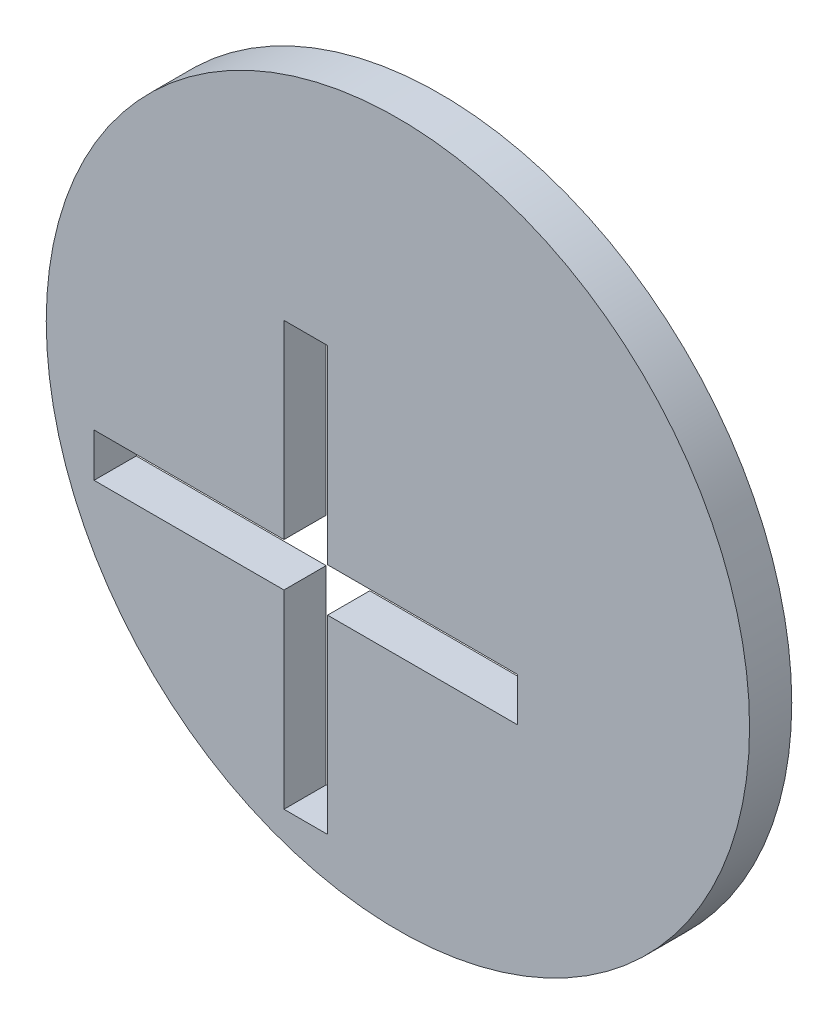
ISO-10303-21;
HEADER;
FILE_DESCRIPTION(('STEP AP214'),'2;1');
FILE_NAME('part.step','',(''),(''),'','','');
FILE_SCHEMA(('AUTOMOTIVE_DESIGN { 1 0 10303 214 1 1 1 1 }'));
ENDSEC;
DATA;
#1=APPLICATION_CONTEXT('core data for automotive mechanical design processes');
#2=APPLICATION_PROTOCOL_DEFINITION('international standard','automotive_design',2000,#1);
#3=PRODUCT_CONTEXT('',#1,'mechanical');
#4=PRODUCT('Part','Part','',(#3));
#5=PRODUCT_RELATED_PRODUCT_CATEGORY('part','',(#4));
#6=PRODUCT_DEFINITION_FORMATION('','',#4);
#7=PRODUCT_DEFINITION_CONTEXT('part definition',#1,'design');
#8=PRODUCT_DEFINITION('design','',#6,#7);
#9=PRODUCT_DEFINITION_SHAPE('','',#8);
#10=(LENGTH_UNIT() NAMED_UNIT(*) SI_UNIT(.MILLI.,.METRE.));
#11=(NAMED_UNIT(*) PLANE_ANGLE_UNIT() SI_UNIT($,.RADIAN.));
#12=(NAMED_UNIT(*) SI_UNIT($,.STERADIAN.) SOLID_ANGLE_UNIT());
#13=UNCERTAINTY_MEASURE_WITH_UNIT(LENGTH_MEASURE(1.E-05),#10,'distance_accuracy_value','');
#14=(GEOMETRIC_REPRESENTATION_CONTEXT(3) GLOBAL_UNCERTAINTY_ASSIGNED_CONTEXT((#13)) GLOBAL_UNIT_ASSIGNED_CONTEXT((#10,
#11,#12)) REPRESENTATION_CONTEXT('',''));
#15=CARTESIAN_POINT('',(0.,0.,0.));
#16=DIRECTION('',(0.,0.,1.));
#17=DIRECTION('',(1.,0.,0.));
#18=AXIS2_PLACEMENT_3D('',#15,#16,#17);
#19=CARTESIAN_POINT('',(6.55,6.55,1.5));
#20=DIRECTION('',(0.,0.,1.));
#21=DIRECTION('',(1.,0.,0.));
#22=AXIS2_PLACEMENT_3D('',#19,#20,#21);
#23=PLANE('',#22);
#24=CARTESIAN_POINT('',(6.55,6.55,1.5));
#25=DIRECTION('',(0.,0.,1.));
#26=DIRECTION('',(1.,0.,0.));
#27=AXIS2_PLACEMENT_3D('',#24,#25,#26);
#28=CIRCLE('',#27,25.);
#29=CARTESIAN_POINT('',(31.55,6.55,1.5));
#30=VERTEX_POINT('',#29);
#31=EDGE_CURVE('E11',#30,#30,#28,.T.);
#32=ORIENTED_EDGE('',*,*,#31,.T.);
#33=EDGE_LOOP('',(#32));
#34=FACE_BOUND('',#33,.T.);
#35=DIRECTION('',(0.,1.,0.));
#36=VECTOR('',#35,1.);
#37=CARTESIAN_POINT('',(15.05,1.55,1.5));
#38=LINE('',#37,#36);
#39=CARTESIAN_POINT('',(15.05,-1.55,1.5));
#40=VERTEX_POINT('',#39);
#41=CARTESIAN_POINT('',(15.05,1.55,1.5));
#42=VERTEX_POINT('',#41);
#43=EDGE_CURVE('E130',#40,#42,#38,.T.);
#44=ORIENTED_EDGE('',*,*,#43,.F.);
#45=DIRECTION('',(1.,0.,0.));
#46=VECTOR('',#45,1.);
#47=CARTESIAN_POINT('',(1.55,-1.55,1.5));
#48=LINE('',#47,#46);
#49=CARTESIAN_POINT('',(1.55,-1.55,1.5));
#50=VERTEX_POINT('',#49);
#51=EDGE_CURVE('E122',#50,#40,#48,.T.);
#52=ORIENTED_EDGE('',*,*,#51,.F.);
#53=DIRECTION('',(0.,1.,0.));
#54=VECTOR('',#53,1.);
#55=CARTESIAN_POINT('',(1.55000000000001,-15.05,1.5));
#56=LINE('',#55,#54);
#57=CARTESIAN_POINT('',(1.55000000000001,-15.05,1.5));
#58=VERTEX_POINT('',#57);
#59=EDGE_CURVE('E162',#58,#50,#56,.T.);
#60=ORIENTED_EDGE('',*,*,#59,.F.);
#61=DIRECTION('',(1.,0.,0.));
#62=VECTOR('',#61,1.);
#63=CARTESIAN_POINT('',(-1.54999999999999,-15.05,1.5));
#64=LINE('',#63,#62);
#65=CARTESIAN_POINT('',(-1.54999999999999,-15.05,1.5));
#66=VERTEX_POINT('',#65);
#67=EDGE_CURVE('E160',#66,#58,#64,.T.);
#68=ORIENTED_EDGE('',*,*,#67,.F.);
#69=DIRECTION('',(0.,-1.,0.));
#70=VECTOR('',#69,1.);
#71=CARTESIAN_POINT('',(-1.54999999999999,-15.05,1.5));
#72=LINE('',#71,#70);
#73=CARTESIAN_POINT('',(-1.55,-1.55,1.5));
#74=VERTEX_POINT('',#73);
#75=EDGE_CURVE('E158',#74,#66,#72,.T.);
#76=ORIENTED_EDGE('',*,*,#75,.F.);
#77=DIRECTION('',(1.,0.,0.));
#78=VECTOR('',#77,1.);
#79=CARTESIAN_POINT('',(-15.05,-1.55,1.5));
#80=LINE('',#79,#78);
#81=CARTESIAN_POINT('',(-15.05,-1.55,1.5));
#82=VERTEX_POINT('',#81);
#83=EDGE_CURVE('E156',#82,#74,#80,.T.);
#84=ORIENTED_EDGE('',*,*,#83,.F.);
#85=DIRECTION('',(0.,-1.,0.));
#86=VECTOR('',#85,1.);
#87=CARTESIAN_POINT('',(-15.05,1.55,1.5));
#88=LINE('',#87,#86);
#89=CARTESIAN_POINT('',(-15.05,1.55,1.5));
#90=VERTEX_POINT('',#89);
#91=EDGE_CURVE('E154',#90,#82,#88,.T.);
#92=ORIENTED_EDGE('',*,*,#91,.F.);
#93=DIRECTION('',(-1.,0.,0.));
#94=VECTOR('',#93,1.);
#95=CARTESIAN_POINT('',(-15.05,1.55,1.5));
#96=LINE('',#95,#94);
#97=CARTESIAN_POINT('',(-1.55,1.55,1.5));
#98=VERTEX_POINT('',#97);
#99=EDGE_CURVE('E152',#98,#90,#96,.T.);
#100=ORIENTED_EDGE('',*,*,#99,.F.);
#101=DIRECTION('',(0.,-1.,0.));
#102=VECTOR('',#101,1.);
#103=CARTESIAN_POINT('',(-1.55,1.55,1.5));
#104=LINE('',#103,#102);
#105=CARTESIAN_POINT('',(-1.54999999999999,15.05,1.5));
#106=VERTEX_POINT('',#105);
#107=EDGE_CURVE('E150',#106,#98,#104,.T.);
#108=ORIENTED_EDGE('',*,*,#107,.F.);
#109=DIRECTION('',(-1.,0.,0.));
#110=VECTOR('',#109,1.);
#111=CARTESIAN_POINT('',(-1.54999999999999,15.05,1.5));
#112=LINE('',#111,#110);
#113=CARTESIAN_POINT('',(1.55000000000001,15.05,1.5));
#114=VERTEX_POINT('',#113);
#115=EDGE_CURVE('E148',#114,#106,#112,.T.);
#116=ORIENTED_EDGE('',*,*,#115,.F.);
#117=DIRECTION('',(0.,1.,0.));
#118=VECTOR('',#117,1.);
#119=CARTESIAN_POINT('',(1.55,1.55,1.5));
#120=LINE('',#119,#118);
#121=CARTESIAN_POINT('',(1.55,1.55,1.5));
#122=VERTEX_POINT('',#121);
#123=EDGE_CURVE('E144',#122,#114,#120,.T.);
#124=ORIENTED_EDGE('',*,*,#123,.F.);
#125=DIRECTION('',(-1.,0.,0.));
#126=VECTOR('',#125,1.);
#127=CARTESIAN_POINT('',(1.55,1.55,1.5));
#128=LINE('',#127,#126);
#129=EDGE_CURVE('E142',#42,#122,#128,.T.);
#130=ORIENTED_EDGE('',*,*,#129,.F.);
#131=EDGE_LOOP('',(#44,#52,#60,#68,#76,#84,#92,#100,#108,#116,#124,#130));
#132=FACE_BOUND('',#131,.T.);
#133=ADVANCED_FACE('F33',(#34,#132),#23,.T.);
#134=CARTESIAN_POINT('',(6.55,6.55,-1.5));
#135=DIRECTION('',(0.,0.,1.));
#136=DIRECTION('',(1.,0.,0.));
#137=AXIS2_PLACEMENT_3D('',#134,#135,#136);
#138=PLANE('',#137);
#139=CARTESIAN_POINT('',(6.55,6.55,-1.5));
#140=DIRECTION('',(0.,0.,1.));
#141=DIRECTION('',(1.,0.,0.));
#142=AXIS2_PLACEMENT_3D('',#139,#140,#141);
#143=CIRCLE('',#142,25.);
#144=CARTESIAN_POINT('',(31.55,6.55,-1.5));
#145=VERTEX_POINT('',#144);
#146=EDGE_CURVE('E37',#145,#145,#143,.T.);
#147=ORIENTED_EDGE('',*,*,#146,.F.);
#148=EDGE_LOOP('',(#147));
#149=FACE_BOUND('',#148,.T.);
#150=DIRECTION('',(1.,0.,0.));
#151=VECTOR('',#150,1.);
#152=CARTESIAN_POINT('',(1.55,-1.55,-1.5));
#153=LINE('',#152,#151);
#154=CARTESIAN_POINT('',(1.55,-1.55,-1.5));
#155=VERTEX_POINT('',#154);
#156=CARTESIAN_POINT('',(15.05,-1.55,-1.5));
#157=VERTEX_POINT('',#156);
#158=EDGE_CURVE('E56',#155,#157,#153,.T.);
#159=ORIENTED_EDGE('',*,*,#158,.T.);
#160=DIRECTION('',(0.,1.,0.));
#161=VECTOR('',#160,1.);
#162=CARTESIAN_POINT('',(15.05,1.55,-1.5));
#163=LINE('',#162,#161);
#164=CARTESIAN_POINT('',(15.05,1.55,-1.5));
#165=VERTEX_POINT('',#164);
#166=EDGE_CURVE('E137',#157,#165,#163,.T.);
#167=ORIENTED_EDGE('',*,*,#166,.T.);
#168=DIRECTION('',(-1.,0.,0.));
#169=VECTOR('',#168,1.);
#170=CARTESIAN_POINT('',(1.55,1.55,-1.5));
#171=LINE('',#170,#169);
#172=CARTESIAN_POINT('',(1.55,1.55,-1.5));
#173=VERTEX_POINT('',#172);
#174=EDGE_CURVE('E166',#165,#173,#171,.T.);
#175=ORIENTED_EDGE('',*,*,#174,.T.);
#176=DIRECTION('',(0.,1.,0.));
#177=VECTOR('',#176,1.);
#178=CARTESIAN_POINT('',(1.55,1.55,-1.5));
#179=LINE('',#178,#177);
#180=CARTESIAN_POINT('',(1.55000000000001,15.05,-1.5));
#181=VERTEX_POINT('',#180);
#182=EDGE_CURVE('E169',#173,#181,#179,.T.);
#183=ORIENTED_EDGE('',*,*,#182,.T.);
#184=DIRECTION('',(-1.,0.,0.));
#185=VECTOR('',#184,1.);
#186=CARTESIAN_POINT('',(-1.54999999999999,15.05,-1.5));
#187=LINE('',#186,#185);
#188=CARTESIAN_POINT('',(-1.54999999999999,15.05,-1.5));
#189=VERTEX_POINT('',#188);
#190=EDGE_CURVE('E172',#181,#189,#187,.T.);
#191=ORIENTED_EDGE('',*,*,#190,.T.);
#192=DIRECTION('',(0.,-1.,0.));
#193=VECTOR('',#192,1.);
#194=CARTESIAN_POINT('',(-1.55,1.55,-1.5));
#195=LINE('',#194,#193);
#196=CARTESIAN_POINT('',(-1.55,1.55,-1.5));
#197=VERTEX_POINT('',#196);
#198=EDGE_CURVE('E175',#189,#197,#195,.T.);
#199=ORIENTED_EDGE('',*,*,#198,.T.);
#200=DIRECTION('',(-1.,0.,0.));
#201=VECTOR('',#200,1.);
#202=CARTESIAN_POINT('',(-15.05,1.55,-1.5));
#203=LINE('',#202,#201);
#204=CARTESIAN_POINT('',(-15.05,1.55,-1.5));
#205=VERTEX_POINT('',#204);
#206=EDGE_CURVE('E178',#197,#205,#203,.T.);
#207=ORIENTED_EDGE('',*,*,#206,.T.);
#208=DIRECTION('',(0.,-1.,0.));
#209=VECTOR('',#208,1.);
#210=CARTESIAN_POINT('',(-15.05,1.55,-1.5));
#211=LINE('',#210,#209);
#212=CARTESIAN_POINT('',(-15.05,-1.55,-1.5));
#213=VERTEX_POINT('',#212);
#214=EDGE_CURVE('E181',#205,#213,#211,.T.);
#215=ORIENTED_EDGE('',*,*,#214,.T.);
#216=DIRECTION('',(1.,0.,0.));
#217=VECTOR('',#216,1.);
#218=CARTESIAN_POINT('',(-15.05,-1.55,-1.5));
#219=LINE('',#218,#217);
#220=CARTESIAN_POINT('',(-1.55,-1.55,-1.5));
#221=VERTEX_POINT('',#220);
#222=EDGE_CURVE('E184',#213,#221,#219,.T.);
#223=ORIENTED_EDGE('',*,*,#222,.T.);
#224=DIRECTION('',(0.,-1.,0.));
#225=VECTOR('',#224,1.);
#226=CARTESIAN_POINT('',(-1.54999999999999,-15.05,-1.5));
#227=LINE('',#226,#225);
#228=CARTESIAN_POINT('',(-1.54999999999999,-15.05,-1.5));
#229=VERTEX_POINT('',#228);
#230=EDGE_CURVE('E187',#221,#229,#227,.T.);
#231=ORIENTED_EDGE('',*,*,#230,.T.);
#232=DIRECTION('',(1.,0.,0.));
#233=VECTOR('',#232,1.);
#234=CARTESIAN_POINT('',(-1.54999999999999,-15.05,-1.5));
#235=LINE('',#234,#233);
#236=CARTESIAN_POINT('',(1.55000000000001,-15.05,-1.5));
#237=VERTEX_POINT('',#236);
#238=EDGE_CURVE('E190',#229,#237,#235,.T.);
#239=ORIENTED_EDGE('',*,*,#238,.T.);
#240=DIRECTION('',(0.,1.,0.));
#241=VECTOR('',#240,1.);
#242=CARTESIAN_POINT('',(1.55000000000001,-15.05,-1.5));
#243=LINE('',#242,#241);
#244=EDGE_CURVE('E131',#237,#155,#243,.T.);
#245=ORIENTED_EDGE('',*,*,#244,.T.);
#246=EDGE_LOOP('',(#159,#167,#175,#183,#191,#199,#207,#215,#223,#231,#239,#245));
#247=FACE_BOUND('',#246,.T.);
#248=ADVANCED_FACE('F219',(#149,#247),#138,.F.);
#249=CARTESIAN_POINT('',(6.55,6.55,1.5));
#250=DIRECTION('',(0.,0.,-1.));
#251=DIRECTION('',(-1.,0.,0.));
#252=AXIS2_PLACEMENT_3D('',#249,#250,#251);
#253=CYLINDRICAL_SURFACE('',#252,25.);
#254=ORIENTED_EDGE('',*,*,#31,.F.);
#255=EDGE_LOOP('',(#254));
#256=FACE_BOUND('',#255,.T.);
#257=ORIENTED_EDGE('',*,*,#146,.T.);
#258=EDGE_LOOP('',(#257));
#259=FACE_BOUND('',#258,.T.);
#260=ADVANCED_FACE('F35',(#256,#259),#253,.T.);
#261=CARTESIAN_POINT('',(1.55,-1.55,1.5));
#262=DIRECTION('',(0.,1.,0.));
#263=DIRECTION('',(0.,0.,1.));
#264=AXIS2_PLACEMENT_3D('',#261,#262,#263);
#265=PLANE('',#264);
#266=ORIENTED_EDGE('',*,*,#158,.F.);
#267=DIRECTION('',(0.,0.,-1.));
#268=VECTOR('',#267,1.);
#269=CARTESIAN_POINT('',(1.55,-1.55,1.5));
#270=LINE('',#269,#268);
#271=EDGE_CURVE('E126',#50,#155,#270,.T.);
#272=ORIENTED_EDGE('',*,*,#271,.F.);
#273=ORIENTED_EDGE('',*,*,#51,.T.);
#274=DIRECTION('',(0.,0.,-1.));
#275=VECTOR('',#274,1.);
#276=CARTESIAN_POINT('',(15.05,-1.55,1.5));
#277=LINE('',#276,#275);
#278=EDGE_CURVE('E125',#40,#157,#277,.T.);
#279=ORIENTED_EDGE('',*,*,#278,.T.);
#280=EDGE_LOOP('',(#266,#272,#273,#279));
#281=FACE_BOUND('',#280,.T.);
#282=ADVANCED_FACE('F124',(#281),#265,.T.);
#283=CARTESIAN_POINT('',(15.05,1.55,1.5));
#284=DIRECTION('',(-1.,0.,0.));
#285=DIRECTION('',(0.,0.,1.));
#286=AXIS2_PLACEMENT_3D('',#283,#284,#285);
#287=PLANE('',#286);
#288=ORIENTED_EDGE('',*,*,#166,.F.);
#289=ORIENTED_EDGE('',*,*,#278,.F.);
#290=ORIENTED_EDGE('',*,*,#43,.T.);
#291=DIRECTION('',(0.,0.,-1.));
#292=VECTOR('',#291,1.);
#293=CARTESIAN_POINT('',(15.05,1.55,1.5));
#294=LINE('',#293,#292);
#295=EDGE_CURVE('E138',#42,#165,#294,.T.);
#296=ORIENTED_EDGE('',*,*,#295,.T.);
#297=EDGE_LOOP('',(#288,#289,#290,#296));
#298=FACE_BOUND('',#297,.T.);
#299=ADVANCED_FACE('F134',(#298),#287,.T.);
#300=CARTESIAN_POINT('',(1.55,1.55,1.5));
#301=DIRECTION('',(0.,-1.,0.));
#302=DIRECTION('',(0.,0.,-1.));
#303=AXIS2_PLACEMENT_3D('',#300,#301,#302);
#304=PLANE('',#303);
#305=ORIENTED_EDGE('',*,*,#174,.F.);
#306=ORIENTED_EDGE('',*,*,#295,.F.);
#307=ORIENTED_EDGE('',*,*,#129,.T.);
#308=DIRECTION('',(0.,0.,-1.));
#309=VECTOR('',#308,1.);
#310=CARTESIAN_POINT('',(1.55,1.55,1.5));
#311=LINE('',#310,#309);
#312=EDGE_CURVE('E211',#122,#173,#311,.T.);
#313=ORIENTED_EDGE('',*,*,#312,.T.);
#314=EDGE_LOOP('',(#305,#306,#307,#313));
#315=FACE_BOUND('',#314,.T.);
#316=ADVANCED_FACE('F215',(#315),#304,.T.);
#317=CARTESIAN_POINT('',(1.55,1.55,1.5));
#318=DIRECTION('',(-1.,0.,0.));
#319=DIRECTION('',(0.,-1.,0.));
#320=AXIS2_PLACEMENT_3D('',#317,#318,#319);
#321=PLANE('',#320);
#322=ORIENTED_EDGE('',*,*,#182,.F.);
#323=ORIENTED_EDGE('',*,*,#312,.F.);
#324=ORIENTED_EDGE('',*,*,#123,.T.);
#325=DIRECTION('',(0.,0.,-1.));
#326=VECTOR('',#325,1.);
#327=CARTESIAN_POINT('',(1.55000000000001,15.05,1.5));
#328=LINE('',#327,#326);
#329=EDGE_CURVE('E209',#114,#181,#328,.T.);
#330=ORIENTED_EDGE('',*,*,#329,.T.);
#331=EDGE_LOOP('',(#322,#323,#324,#330));
#332=FACE_BOUND('',#331,.T.);
#333=ADVANCED_FACE('F257',(#332),#321,.T.);
#334=CARTESIAN_POINT('',(-1.54999999999999,15.05,1.5));
#335=DIRECTION('',(0.,-1.,0.));
#336=DIRECTION('',(0.,0.,-1.));
#337=AXIS2_PLACEMENT_3D('',#334,#335,#336);
#338=PLANE('',#337);
#339=ORIENTED_EDGE('',*,*,#190,.F.);
#340=ORIENTED_EDGE('',*,*,#329,.F.);
#341=ORIENTED_EDGE('',*,*,#115,.T.);
#342=DIRECTION('',(0.,0.,-1.));
#343=VECTOR('',#342,1.);
#344=CARTESIAN_POINT('',(-1.54999999999999,15.05,1.5));
#345=LINE('',#344,#343);
#346=EDGE_CURVE('E207',#106,#189,#345,.T.);
#347=ORIENTED_EDGE('',*,*,#346,.T.);
#348=EDGE_LOOP('',(#339,#340,#341,#347));
#349=FACE_BOUND('',#348,.T.);
#350=ADVANCED_FACE('F255',(#349),#338,.T.);
#351=CARTESIAN_POINT('',(-1.55,1.55,1.5));
#352=DIRECTION('',(1.,0.,0.));
#353=DIRECTION('',(0.,1.,0.));
#354=AXIS2_PLACEMENT_3D('',#351,#352,#353);
#355=PLANE('',#354);
#356=ORIENTED_EDGE('',*,*,#198,.F.);
#357=ORIENTED_EDGE('',*,*,#346,.F.);
#358=ORIENTED_EDGE('',*,*,#107,.T.);
#359=DIRECTION('',(0.,0.,-1.));
#360=VECTOR('',#359,1.);
#361=CARTESIAN_POINT('',(-1.55,1.55,1.5));
#362=LINE('',#361,#360);
#363=EDGE_CURVE('E205',#98,#197,#362,.T.);
#364=ORIENTED_EDGE('',*,*,#363,.T.);
#365=EDGE_LOOP('',(#356,#357,#358,#364));
#366=FACE_BOUND('',#365,.T.);
#367=ADVANCED_FACE('F249',(#366),#355,.T.);
#368=CARTESIAN_POINT('',(-15.05,1.55,1.5));
#369=DIRECTION('',(0.,-1.,0.));
#370=DIRECTION('',(0.,0.,-1.));
#371=AXIS2_PLACEMENT_3D('',#368,#369,#370);
#372=PLANE('',#371);
#373=ORIENTED_EDGE('',*,*,#206,.F.);
#374=ORIENTED_EDGE('',*,*,#363,.F.);
#375=ORIENTED_EDGE('',*,*,#99,.T.);
#376=DIRECTION('',(0.,0.,-1.));
#377=VECTOR('',#376,1.);
#378=CARTESIAN_POINT('',(-15.05,1.55,1.5));
#379=LINE('',#378,#377);
#380=EDGE_CURVE('E203',#90,#205,#379,.T.);
#381=ORIENTED_EDGE('',*,*,#380,.T.);
#382=EDGE_LOOP('',(#373,#374,#375,#381));
#383=FACE_BOUND('',#382,.T.);
#384=ADVANCED_FACE('F245',(#383),#372,.T.);
#385=CARTESIAN_POINT('',(-15.05,1.55,1.5));
#386=DIRECTION('',(1.,0.,0.));
#387=DIRECTION('',(0.,0.,-1.));
#388=AXIS2_PLACEMENT_3D('',#385,#386,#387);
#389=PLANE('',#388);
#390=ORIENTED_EDGE('',*,*,#214,.F.);
#391=ORIENTED_EDGE('',*,*,#380,.F.);
#392=ORIENTED_EDGE('',*,*,#91,.T.);
#393=DIRECTION('',(0.,0.,-1.));
#394=VECTOR('',#393,1.);
#395=CARTESIAN_POINT('',(-15.05,-1.55,1.5));
#396=LINE('',#395,#394);
#397=EDGE_CURVE('E201',#82,#213,#396,.T.);
#398=ORIENTED_EDGE('',*,*,#397,.T.);
#399=EDGE_LOOP('',(#390,#391,#392,#398));
#400=FACE_BOUND('',#399,.T.);
#401=ADVANCED_FACE('F242',(#400),#389,.T.);
#402=CARTESIAN_POINT('',(-15.05,-1.55,1.5));
#403=DIRECTION('',(0.,1.,0.));
#404=DIRECTION('',(0.,0.,1.));
#405=AXIS2_PLACEMENT_3D('',#402,#403,#404);
#406=PLANE('',#405);
#407=ORIENTED_EDGE('',*,*,#222,.F.);
#408=ORIENTED_EDGE('',*,*,#397,.F.);
#409=ORIENTED_EDGE('',*,*,#83,.T.);
#410=DIRECTION('',(0.,0.,-1.));
#411=VECTOR('',#410,1.);
#412=CARTESIAN_POINT('',(-1.55,-1.55,1.5));
#413=LINE('',#412,#411);
#414=EDGE_CURVE('E199',#74,#221,#413,.T.);
#415=ORIENTED_EDGE('',*,*,#414,.T.);
#416=EDGE_LOOP('',(#407,#408,#409,#415));
#417=FACE_BOUND('',#416,.T.);
#418=ADVANCED_FACE('F234',(#417),#406,.T.);
#419=CARTESIAN_POINT('',(-1.54999999999999,-15.05,1.5));
#420=DIRECTION('',(1.,0.,0.));
#421=DIRECTION('',(0.,1.,0.));
#422=AXIS2_PLACEMENT_3D('',#419,#420,#421);
#423=PLANE('',#422);
#424=ORIENTED_EDGE('',*,*,#230,.F.);
#425=ORIENTED_EDGE('',*,*,#414,.F.);
#426=ORIENTED_EDGE('',*,*,#75,.T.);
#427=DIRECTION('',(0.,0.,-1.));
#428=VECTOR('',#427,1.);
#429=CARTESIAN_POINT('',(-1.54999999999999,-15.05,1.5));
#430=LINE('',#429,#428);
#431=EDGE_CURVE('E197',#66,#229,#430,.T.);
#432=ORIENTED_EDGE('',*,*,#431,.T.);
#433=EDGE_LOOP('',(#424,#425,#426,#432));
#434=FACE_BOUND('',#433,.T.);
#435=ADVANCED_FACE('F230',(#434),#423,.T.);
#436=CARTESIAN_POINT('',(-1.54999999999999,-15.05,1.5));
#437=DIRECTION('',(0.,1.,0.));
#438=DIRECTION('',(0.,0.,1.));
#439=AXIS2_PLACEMENT_3D('',#436,#437,#438);
#440=PLANE('',#439);
#441=ORIENTED_EDGE('',*,*,#238,.F.);
#442=ORIENTED_EDGE('',*,*,#431,.F.);
#443=ORIENTED_EDGE('',*,*,#67,.T.);
#444=DIRECTION('',(0.,0.,-1.));
#445=VECTOR('',#444,1.);
#446=CARTESIAN_POINT('',(1.55000000000001,-15.05,1.5));
#447=LINE('',#446,#445);
#448=EDGE_CURVE('E48',#58,#237,#447,.T.);
#449=ORIENTED_EDGE('',*,*,#448,.T.);
#450=EDGE_LOOP('',(#441,#442,#443,#449));
#451=FACE_BOUND('',#450,.T.);
#452=ADVANCED_FACE('F227',(#451),#440,.T.);
#453=CARTESIAN_POINT('',(1.55000000000001,-15.05,1.5));
#454=DIRECTION('',(-1.,0.,0.));
#455=DIRECTION('',(0.,-1.,0.));
#456=AXIS2_PLACEMENT_3D('',#453,#454,#455);
#457=PLANE('',#456);
#458=ORIENTED_EDGE('',*,*,#244,.F.);
#459=ORIENTED_EDGE('',*,*,#448,.F.);
#460=ORIENTED_EDGE('',*,*,#59,.T.);
#461=ORIENTED_EDGE('',*,*,#271,.T.);
#462=EDGE_LOOP('',(#458,#459,#460,#461));
#463=FACE_BOUND('',#462,.T.);
#464=ADVANCED_FACE('F221',(#463),#457,.T.);
#465=CLOSED_SHELL('',(#133,#248,#260,#282,#299,#316,#333,#350,#367,#384,#401,#418,#435,#452,#464));
#466=MANIFOLD_SOLID_BREP('B2',#465);
#467=ADVANCED_BREP_SHAPE_REPRESENTATION('',(#18,#466),#14);
#468=SHAPE_DEFINITION_REPRESENTATION(#9,#467);
ENDSEC;
END-ISO-10303-21;
